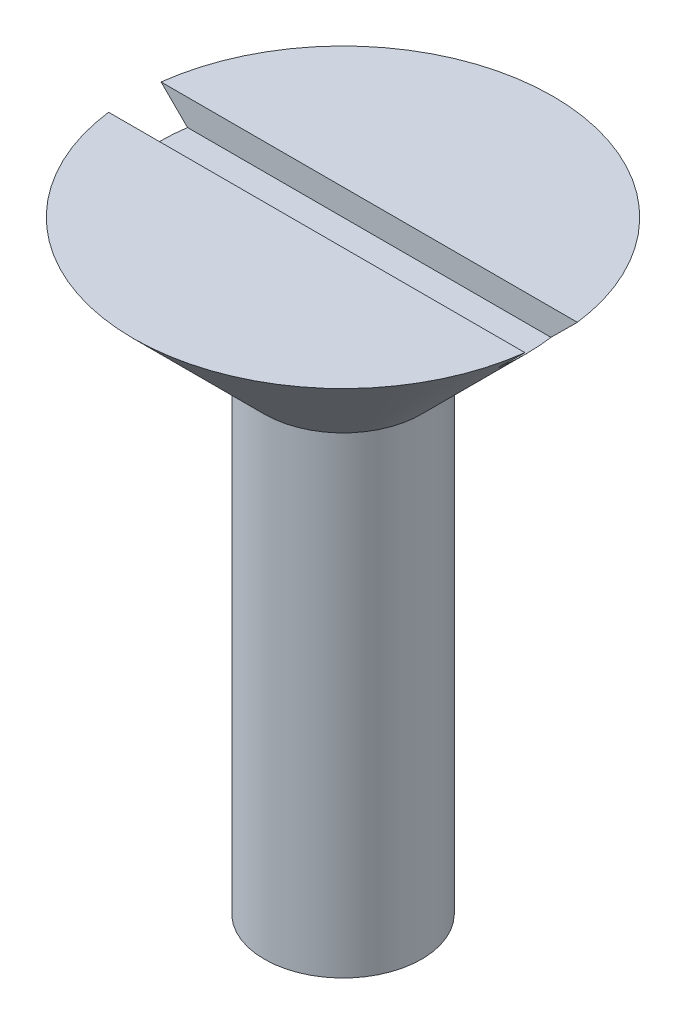
ISO-10303-21;
HEADER;
FILE_DESCRIPTION(('STEP AP214'),'2;1');
FILE_NAME('part.step','',(''),(''),'','','');
FILE_SCHEMA(('AUTOMOTIVE_DESIGN { 1 0 10303 214 1 1 1 1 }'));
ENDSEC;
DATA;
#1=APPLICATION_CONTEXT('core data for automotive mechanical design processes');
#2=APPLICATION_PROTOCOL_DEFINITION('international standard','automotive_design',2000,#1);
#3=PRODUCT_CONTEXT('',#1,'mechanical');
#4=PRODUCT('Part','Part','',(#3));
#5=PRODUCT_RELATED_PRODUCT_CATEGORY('part','',(#4));
#6=PRODUCT_DEFINITION_FORMATION('','',#4);
#7=PRODUCT_DEFINITION_CONTEXT('part definition',#1,'design');
#8=PRODUCT_DEFINITION('design','',#6,#7);
#9=PRODUCT_DEFINITION_SHAPE('','',#8);
#10=(LENGTH_UNIT() NAMED_UNIT(*) SI_UNIT(.MILLI.,.METRE.));
#11=(NAMED_UNIT(*) PLANE_ANGLE_UNIT() SI_UNIT($,.RADIAN.));
#12=(NAMED_UNIT(*) SI_UNIT($,.STERADIAN.) SOLID_ANGLE_UNIT());
#13=UNCERTAINTY_MEASURE_WITH_UNIT(LENGTH_MEASURE(1.E-05),#10,'distance_accuracy_value','');
#14=(GEOMETRIC_REPRESENTATION_CONTEXT(3) GLOBAL_UNCERTAINTY_ASSIGNED_CONTEXT((#13)) GLOBAL_UNIT_ASSIGNED_CONTEXT((#10,
#11,#12)) REPRESENTATION_CONTEXT('',''));
#15=CARTESIAN_POINT('',(0.,0.,0.));
#16=DIRECTION('',(0.,0.,1.));
#17=DIRECTION('',(1.,0.,0.));
#18=AXIS2_PLACEMENT_3D('',#15,#16,#17);
#19=CARTESIAN_POINT('',(0.,14.,0.));
#20=DIRECTION('',(0.,-1.,0.));
#21=DIRECTION('',(0.,0.,-1.));
#22=AXIS2_PLACEMENT_3D('',#19,#20,#21);
#23=PLANE('',#22);
#24=CARTESIAN_POINT('',(0.,14.,0.));
#25=DIRECTION('',(0.,1.,0.));
#26=DIRECTION('',(0.,0.,1.));
#27=AXIS2_PLACEMENT_3D('',#24,#25,#26);
#28=CIRCLE('',#27,7.99999999999998);
#29=CARTESIAN_POINT('',(7.93725393319376,14.,-1.));
#30=VERTEX_POINT('',#29);
#31=CARTESIAN_POINT('',(-7.93725393319375,14.,-1.));
#32=VERTEX_POINT('',#31);
#33=EDGE_CURVE('E92',#30,#32,#28,.T.);
#34=ORIENTED_EDGE('',*,*,#33,.T.);
#35=DIRECTION('',(1.,0.,0.));
#36=VECTOR('',#35,1.);
#37=CARTESIAN_POINT('',(0.,14.,-1.));
#38=LINE('',#37,#36);
#39=EDGE_CURVE('E81',#32,#30,#38,.T.);
#40=ORIENTED_EDGE('',*,*,#39,.T.);
#41=EDGE_LOOP('',(#34,#40));
#42=FACE_BOUND('',#41,.T.);
#43=ADVANCED_FACE('F33',(#42),#23,.F.);
#44=CARTESIAN_POINT('',(0.,9.,0.));
#45=DIRECTION('',(0.,1.,0.));
#46=DIRECTION('',(0.,0.,1.));
#47=AXIS2_PLACEMENT_3D('',#44,#45,#46);
#48=CONICAL_SURFACE('',#47,3.,0.785398163397447);
#49=CARTESIAN_POINT('',(0.,13.,0.));
#50=DIRECTION('',(0.,-1.,0.));
#51=DIRECTION('',(0.,0.,-1.));
#52=AXIS2_PLACEMENT_3D('',#49,#50,#51);
#53=CIRCLE('',#52,6.99999999999998);
#54=CARTESIAN_POINT('',(-6.92820323027549,13.,1.));
#55=VERTEX_POINT('',#54);
#56=CARTESIAN_POINT('',(-6.92820323027549,13.,-1.));
#57=VERTEX_POINT('',#56);
#58=EDGE_CURVE('E11',#55,#57,#53,.T.);
#59=ORIENTED_EDGE('',*,*,#58,.T.);
#60=CARTESIAN_POINT('',(17.5905302687198,23.6189317251288,-1.));
#61=CARTESIAN_POINT('',(16.9921066626598,23.0214800232055,-1.));
#62=CARTESIAN_POINT('',(16.3936408075219,22.4240706192128,-1.));
#63=CARTESIAN_POINT('',(15.196565027162,21.2293826627781,-1.));
#64=CARTESIAN_POINT('',(14.5979551003902,20.6321041118889,-1.));
#65=CARTESIAN_POINT('',(13.4003937558491,19.4375866359061,-1.));
#66=CARTESIAN_POINT('',(12.8014422900068,18.8403477590018,-1.));
#67=CARTESIAN_POINT('',(11.603257334266,17.6461661568175,-1.));
#68=CARTESIAN_POINT('',(11.0040238475453,17.0492234283494,-1.));
#69=CARTESIAN_POINT('',(9.7847582236038,15.8355425663744,-1.));
#70=CARTESIAN_POINT('',(9.16471041380419,15.2188201700583,-1.));
#71=CARTESIAN_POINT('',(8.23396656445527,14.2943918251065,-1.));
#72=CARTESIAN_POINT('',(7.92360124411733,13.9863529550664,-1.));
#73=CARTESIAN_POINT('',(7.30255555881147,13.3705950160447,-1.));
#74=CARTESIAN_POINT('',(6.99187519491007,13.0628759459874,-1.));
#75=CARTESIAN_POINT('',(6.37010401008026,12.4479526103779,-1.));
#76=CARTESIAN_POINT('',(6.05901326326565,12.1407482699372,-1.));
#77=CARTESIAN_POINT('',(5.43610970373195,11.5270643796558,-1.));
#78=CARTESIAN_POINT('',(5.12429688170295,11.2205848392643,-1.));
#79=CARTESIAN_POINT('',(4.49951156578897,10.6088449025209,-1.));
#80=CARTESIAN_POINT('',(4.18653914373778,10.3035844330072,-1.));
#81=CARTESIAN_POINT('',(3.7154035193183,9.84743132198102,-1.));
#82=CARTESIAN_POINT('',(3.55808044623061,9.69567144236141,-1.));
#83=CARTESIAN_POINT('',(3.24261115812736,9.39301012036289,-1.));
#84=CARTESIAN_POINT('',(3.08446494993228,9.24210867089266,-1.));
#85=CARTESIAN_POINT('',(2.88297041268774,9.05144754805751,-1.));
#86=CARTESIAN_POINT('',(2.84020462566703,9.01107215088935,-1.));
#87=CARTESIAN_POINT('',(2.75456797785924,8.93043274981185,-1.));
#88=CARTESIAN_POINT('',(2.71169711684696,8.89016874614164,-1.));
#89=CARTESIAN_POINT('',(2.58290562731864,8.7695652821317,-1.));
#90=CARTESIAN_POINT('',(2.49680723382454,8.68941545042782,-1.));
#91=CARTESIAN_POINT('',(2.3242779436887,8.53005409276721,-1.));
#92=CARTESIAN_POINT('',(2.23784912386126,8.45084032443019,-1.));
#93=CARTESIAN_POINT('',(2.06415658614781,8.29334065089302,-1.));
#94=CARTESIAN_POINT('',(1.97689289761326,8.21505471328821,-1.));
#95=CARTESIAN_POINT('',(1.77142747941351,8.03343659901735,-1.));
#96=CARTESIAN_POINT('',(1.65276973736519,7.93061397406147,-1.));
#97=CARTESIAN_POINT('',(1.47184772133814,7.77911885803057,-1.));
#98=CARTESIAN_POINT('',(1.41085897886966,7.72892683246099,-1.));
#99=CARTESIAN_POINT('',(1.28772085809631,7.62999161500929,-1.));
#100=CARTESIAN_POINT('',(1.22557159472625,7.58124828087892,-1.));
#101=CARTESIAN_POINT('',(1.09893092584816,7.4852336783047,-1.));
#102=CARTESIAN_POINT('',(1.03442014565076,7.43798778887903,-1.));
#103=CARTESIAN_POINT('',(0.903077346685914,7.34659413826808,-1.));
#104=CARTESIAN_POINT('',(0.836242364310852,7.30245056688251,-1.));
#105=CARTESIAN_POINT('',(0.700082271665347,7.21951165683876,-1.));
#106=CARTESIAN_POINT('',(0.630783821373029,7.18067320865143,-1.));
#107=CARTESIAN_POINT('',(0.488249961599324,7.11110262221831,-1.));
#108=CARTESIAN_POINT('',(0.415027354221666,7.08034585094755,-1.));
#109=CARTESIAN_POINT('',(0.305295681949306,7.04505988461626,-1.));
#110=CARTESIAN_POINT('',(0.270458983603069,7.03536077383307,-1.));
#111=CARTESIAN_POINT('',(0.200025610437724,7.01923304310288,-1.));
#112=CARTESIAN_POINT('',(0.164429059807317,7.01280389292049,-1.));
#113=CARTESIAN_POINT('',(0.0929594885366785,7.00369029330408,-1.));
#114=CARTESIAN_POINT('',(0.0570892602674354,7.00098438681967,-1.));
#115=CARTESIAN_POINT('',(-0.0147355703830216,6.99946402167183,-1.));
#116=CARTESIAN_POINT('',(-0.0506901721490982,7.00064953472498,-1.));
#117=CARTESIAN_POINT('',(-0.122126081683583,7.00680294241904,-1.));
#118=CARTESIAN_POINT('',(-0.157608683251817,7.01175616902627,-1.));
#119=CARTESIAN_POINT('',(-0.227933015011514,7.0250654724445,-1.));
#120=CARTESIAN_POINT('',(-0.262774448908409,7.03342308315759,-1.));
#121=CARTESIAN_POINT('',(-0.331868652820795,7.05310521473586,-1.));
#122=CARTESIAN_POINT('',(-0.366115319167721,7.06445081811461,-1.));
#123=CARTESIAN_POINT('',(-0.433697243700892,7.08954549868784,-1.));
#124=CARTESIAN_POINT('',(-0.467032628448915,7.10329424014533,-1.));
#125=CARTESIAN_POINT('',(-0.556369473104637,7.14323682745065,-1.));
#126=CARTESIAN_POINT('',(-0.611531502099558,7.17129912801516,-1.));
#127=CARTESIAN_POINT('',(-0.719746479188068,7.23126222613431,-1.));
#128=CARTESIAN_POINT('',(-0.772797073886971,7.26316715559846,-1.));
#129=CARTESIAN_POINT('',(-0.877378905629743,7.3297232706074,-1.));
#130=CARTESIAN_POINT('',(-0.928904513833071,7.36438322182091,-1.));
#131=CARTESIAN_POINT('',(-1.03064155428344,7.43558477652545,-1.));
#132=CARTESIAN_POINT('',(-1.08085273057067,7.47212674245088,-1.));
#133=CARTESIAN_POINT('',(-1.18069676212704,7.54691384093614,-1.));
#134=CARTESIAN_POINT('',(-1.23032026389647,7.58517139936918,-1.));
#135=CARTESIAN_POINT('',(-1.32875090858554,7.6627271929109,-1.));
#136=CARTESIAN_POINT('',(-1.3775579807495,7.70202551746274,-1.));
#137=CARTESIAN_POINT('',(-1.47440842921627,7.78132235461105,-1.));
#138=CARTESIAN_POINT('',(-1.52245332021948,7.82131902199806,-1.));
#139=CARTESIAN_POINT('',(-1.61801935988398,7.90192803586136,-1.));
#140=CARTESIAN_POINT('',(-1.66554052949055,7.94254035756022,-1.));
#141=CARTESIAN_POINT('',(-1.8054824192699,8.06338835106973,-1.));
#142=CARTESIAN_POINT('',(-1.89730724317153,8.14431360555889,-1.));
#143=CARTESIAN_POINT('',(-2.07985098832569,8.3074037707118,-1.));
#144=CARTESIAN_POINT('',(-2.17056985929147,8.38956873736692,-1.));
#145=CARTESIAN_POINT('',(-2.35122191691888,8.5547816615605,-1.));
#146=CARTESIAN_POINT('',(-2.4411549935154,8.63782973929464,-1.));
#147=CARTESIAN_POINT('',(-2.62042933743661,8.8045627437366,-1.));
#148=CARTESIAN_POINT('',(-2.7097705994131,8.88824767618501,-1.));
#149=CARTESIAN_POINT('',(-2.97733915094248,9.14020804513012,-1.));
#150=CARTESIAN_POINT('',(-3.15489818069136,9.30919266724204,-1.));
#151=CARTESIAN_POINT('',(-3.50891525001108,9.64827881532111,-1.));
#152=CARTESIAN_POINT('',(-3.68537337815984,9.81838024910975,-1.));
#153=CARTESIAN_POINT('',(-4.03579332978233,10.1576096662065,-1.));
#154=CARTESIAN_POINT('',(-4.20976238753321,10.3267301803555,-1.));
#155=CARTESIAN_POINT('',(-4.55721168919067,10.6654794736863,-1.));
#156=CARTESIAN_POINT('',(-4.73069192269327,10.8351082635297,-1.));
#157=CARTESIAN_POINT('',(-5.25043504390502,11.3443635571965,-1.));
#158=CARTESIAN_POINT('',(-5.59617242203998,11.6845261954296,-1.));
#159=CARTESIAN_POINT('',(-6.42446591619127,12.5013362513776,-1.));
#160=CARTESIAN_POINT('',(-6.90664843932399,12.9783620376579,-1.));
#161=CARTESIAN_POINT('',(-7.87020912978405,13.9332280726438,-1.));
#162=CARTESIAN_POINT('',(-8.3515872943149,14.4110683241695,-1.));
#163=CARTESIAN_POINT('',(-9.31396340509058,15.3673365963454,-1.));
#164=CARTESIAN_POINT('',(-9.79496124833594,15.8457647206249,-1.));
#165=CARTESIAN_POINT('',(-10.7566474889435,16.802930678605,-1.));
#166=CARTESIAN_POINT('',(-11.2373358866711,17.2816685119385,-1.));
#167=CARTESIAN_POINT('',(-12.2076531683375,18.2484719747768,-1.));
#168=CARTESIAN_POINT('',(-12.6972780186468,18.7365416521831,-1.));
#169=CARTESIAN_POINT('',(-13.6763743158692,19.7128352301166,-1.));
#170=CARTESIAN_POINT('',(-14.1658457627211,20.2010591307051,-1.));
#171=CARTESIAN_POINT('',(-15.1445674016934,21.1775099268687,-1.));
#172=CARTESIAN_POINT('',(-15.6338176188142,21.6657367973865,-1.));
#173=CARTESIAN_POINT('',(-16.6122319660961,22.6422763546546,-1.));
#174=CARTESIAN_POINT('',(-17.1013960962956,23.1305890413662,-1.));
#175=CARTESIAN_POINT('',(-17.5905302687198,23.6189317251288,-1.));
#176=B_SPLINE_CURVE_WITH_KNOTS('',3,(#60,#61,#62,#63,#64,#65,#66,#67,#68,#69,#70,#71,#72,#73,
#74,#75,#76,#77,#78,#79,#80,#81,#82,#83,#84,#85,#86,#87,#88,#89,#90,#91,#92,#93,#94,#95,#96,#97,
#98,#99,#100,#101,#102,#103,#104,#105,#106,#107,#108,#109,#110,#111,#112,#113,#114,#115,#116,
#117,#118,#119,#120,#121,#122,#123,#124,#125,#126,#127,#128,#129,#130,#131,#132,#133,#134,#135,
#136,#137,#138,#139,#140,#141,#142,#143,#144,#145,#146,#147,#148,#149,#150,#151,#152,#153,#154,
#155,#156,#157,#158,#159,#160,#161,#162,#163,#164,#165,#166,#167,#168,#169,#170,#171,#172,#173,
#174,#175),.UNSPECIFIED.,.F.,.F.,(4,2,2,2,2,2,2,2,2,2,2,2,2,2,2,2,2,2,2,2,2,2,2,2,2,2,2,2,2,2,2,
2,2,2,2,2,2,2,2,2,2,2,2,2,2,2,2,2,2,2,2,2,2,2,2,2,2,4),(0.,2.53683547484964,5.07369958126534,
7.61120501536626,10.1486825124165,12.7722771985783,14.0841197040112,15.3959577832198,
16.707584715461,18.0192286540663,19.330792655159,19.9865611093225,20.6423241384291,
20.8187659370602,20.9952081141862,21.3480971860885,21.6998053647098,22.0515012234452,
22.5224662329011,22.759410956754,22.9963323374189,23.2361588182638,23.4763032056306,
23.7143624713616,23.9516874848543,24.0600441435376,24.1683832262085,24.2760952982039,
24.3838065873334,24.4911006797618,24.5984431689025,24.7065643328738,24.8146704035377,
25.0000887091543,25.1857082022667,25.371943935063,25.5582156678338,25.7461740706937,
25.9341486794019,26.12168521691,26.309214226816,26.6763815899282,27.0435655860253,
27.41080021412,27.7780381563857,28.5133831976557,29.2486682900513,29.9765422639681,
30.704431614447,32.1594905268424,34.1943063558045,36.229129244471,38.2643861528643,
40.2996406531458,42.3736465207807,44.4476532154235,46.5211963714275,48.5947386001912),.UNSPECIFIED.);
#177=EDGE_CURVE('E97',#57,#32,#176,.T.);
#178=ORIENTED_EDGE('',*,*,#177,.T.);
#179=ORIENTED_EDGE('',*,*,#33,.F.);
#180=CARTESIAN_POINT('',(6.92820323027549,13.,-1.));
#181=VERTEX_POINT('',#180);
#182=EDGE_CURVE('E93',#30,#181,#176,.T.);
#183=ORIENTED_EDGE('',*,*,#182,.T.);
#184=CARTESIAN_POINT('',(6.92820323027549,13.,1.));
#185=VERTEX_POINT('',#184);
#186=EDGE_CURVE('E38',#181,#185,#53,.T.);
#187=ORIENTED_EDGE('',*,*,#186,.T.);
#188=CARTESIAN_POINT('',(-17.5905302687198,23.6189317251288,1.));
#189=CARTESIAN_POINT('',(-16.9921066626598,23.0214800232055,1.));
#190=CARTESIAN_POINT('',(-16.3936408075219,22.4240706192128,1.));
#191=CARTESIAN_POINT('',(-15.196565027162,21.2293826627781,1.));
#192=CARTESIAN_POINT('',(-14.5979551003902,20.6321041118889,1.));
#193=CARTESIAN_POINT('',(-13.4003937558491,19.4375866359061,1.));
#194=CARTESIAN_POINT('',(-12.8014422900068,18.8403477590017,1.));
#195=CARTESIAN_POINT('',(-11.603257334266,17.6461661568175,1.));
#196=CARTESIAN_POINT('',(-11.0040238475453,17.0492234283494,1.));
#197=CARTESIAN_POINT('',(-9.78475822360379,15.8355425663744,1.));
#198=CARTESIAN_POINT('',(-9.16471041380419,15.2188201700583,1.));
#199=CARTESIAN_POINT('',(-8.23396656445526,14.2943918251065,1.));
#200=CARTESIAN_POINT('',(-7.92360124411733,13.9863529550664,1.));
#201=CARTESIAN_POINT('',(-7.30255555881147,13.3705950160447,1.));
#202=CARTESIAN_POINT('',(-6.99187519491006,13.0628759459874,1.));
#203=CARTESIAN_POINT('',(-6.37010401008026,12.4479526103779,1.));
#204=CARTESIAN_POINT('',(-6.05901326326565,12.1407482699372,1.));
#205=CARTESIAN_POINT('',(-5.43610970373195,11.5270643796558,1.));
#206=CARTESIAN_POINT('',(-5.12429688170295,11.2205848392643,1.));
#207=CARTESIAN_POINT('',(-4.49951156578898,10.6088449025209,1.));
#208=CARTESIAN_POINT('',(-4.18653914373779,10.3035844330072,1.));
#209=CARTESIAN_POINT('',(-3.7154035193183,9.84743132198102,1.));
#210=CARTESIAN_POINT('',(-3.55808044623061,9.69567144236142,1.));
#211=CARTESIAN_POINT('',(-3.24261115812736,9.39301012036289,1.));
#212=CARTESIAN_POINT('',(-3.08446494993228,9.24210867089267,1.));
#213=CARTESIAN_POINT('',(-2.88297041268774,9.05144754805751,1.));
#214=CARTESIAN_POINT('',(-2.84020462566703,9.01107215088935,1.));
#215=CARTESIAN_POINT('',(-2.75456797785924,8.93043274981185,1.));
#216=CARTESIAN_POINT('',(-2.71169711684696,8.89016874614164,1.));
#217=CARTESIAN_POINT('',(-2.58290562731864,8.7695652821317,1.));
#218=CARTESIAN_POINT('',(-2.49680723382454,8.68941545042782,1.));
#219=CARTESIAN_POINT('',(-2.3242779436887,8.53005409276721,1.));
#220=CARTESIAN_POINT('',(-2.23784912386126,8.45084032443019,1.));
#221=CARTESIAN_POINT('',(-2.06415658614781,8.29334065089302,1.));
#222=CARTESIAN_POINT('',(-1.97689289761326,8.21505471328821,1.));
#223=CARTESIAN_POINT('',(-1.77142747941351,8.03343659901735,1.));
#224=CARTESIAN_POINT('',(-1.65276973736519,7.93061397406147,1.));
#225=CARTESIAN_POINT('',(-1.47184772133814,7.77911885803057,1.));
#226=CARTESIAN_POINT('',(-1.41085897886966,7.72892683246099,1.));
#227=CARTESIAN_POINT('',(-1.28772085809631,7.62999161500929,1.));
#228=CARTESIAN_POINT('',(-1.22557159472625,7.58124828087892,1.));
#229=CARTESIAN_POINT('',(-1.09893092584816,7.4852336783047,1.));
#230=CARTESIAN_POINT('',(-1.03442014565076,7.43798778887903,1.));
#231=CARTESIAN_POINT('',(-0.903077346685913,7.34659413826808,1.));
#232=CARTESIAN_POINT('',(-0.836242364310851,7.30245056688251,1.));
#233=CARTESIAN_POINT('',(-0.700082271665346,7.21951165683876,1.));
#234=CARTESIAN_POINT('',(-0.630783821373028,7.18067320865143,1.));
#235=CARTESIAN_POINT('',(-0.488249961599324,7.11110262221831,1.));
#236=CARTESIAN_POINT('',(-0.415027354221666,7.08034585094755,1.));
#237=CARTESIAN_POINT('',(-0.305295681949306,7.04505988461626,1.));
#238=CARTESIAN_POINT('',(-0.27045898360307,7.03536077383307,1.));
#239=CARTESIAN_POINT('',(-0.200025610437726,7.01923304310289,1.));
#240=CARTESIAN_POINT('',(-0.164429059807318,7.0128038929205,1.));
#241=CARTESIAN_POINT('',(-0.0929594885366797,7.00369029330408,1.));
#242=CARTESIAN_POINT('',(-0.0570892602674369,7.00098438681967,1.));
#243=CARTESIAN_POINT('',(0.0147355703830209,6.99946402167183,1.));
#244=CARTESIAN_POINT('',(0.0506901721490985,7.00064953472498,1.));
#245=CARTESIAN_POINT('',(0.122126081683585,7.00680294241904,1.));
#246=CARTESIAN_POINT('',(0.157608683251821,7.01175616902627,1.));
#247=CARTESIAN_POINT('',(0.227933015011519,7.0250654724445,1.));
#248=CARTESIAN_POINT('',(0.262774448908414,7.03342308315759,1.));
#249=CARTESIAN_POINT('',(0.331868652820799,7.05310521473586,1.));
#250=CARTESIAN_POINT('',(0.366115319167723,7.06445081811461,1.));
#251=CARTESIAN_POINT('',(0.433697243700893,7.08954549868784,1.));
#252=CARTESIAN_POINT('',(0.467032628448916,7.10329424014533,1.));
#253=CARTESIAN_POINT('',(0.556369473104638,7.14323682745065,1.));
#254=CARTESIAN_POINT('',(0.61153150209956,7.17129912801516,1.));
#255=CARTESIAN_POINT('',(0.71974647918807,7.23126222613431,1.));
#256=CARTESIAN_POINT('',(0.772797073886973,7.26316715559846,1.));
#257=CARTESIAN_POINT('',(0.877378905629745,7.3297232706074,1.));
#258=CARTESIAN_POINT('',(0.928904513833073,7.36438322182091,1.));
#259=CARTESIAN_POINT('',(1.03064155428344,7.43558477652545,1.));
#260=CARTESIAN_POINT('',(1.08085273057067,7.47212674245088,1.));
#261=CARTESIAN_POINT('',(1.18069676212704,7.54691384093614,1.));
#262=CARTESIAN_POINT('',(1.23032026389647,7.58517139936918,1.));
#263=CARTESIAN_POINT('',(1.32875090858554,7.6627271929109,1.));
#264=CARTESIAN_POINT('',(1.37755798074951,7.70202551746274,1.));
#265=CARTESIAN_POINT('',(1.47440842921627,7.78132235461105,1.));
#266=CARTESIAN_POINT('',(1.52245332021948,7.82131902199807,1.));
#267=CARTESIAN_POINT('',(1.61801935988398,7.90192803586137,1.));
#268=CARTESIAN_POINT('',(1.66554052949055,7.94254035756022,1.));
#269=CARTESIAN_POINT('',(1.8054824192699,8.06338835106973,1.));
#270=CARTESIAN_POINT('',(1.89730724317153,8.1443136055589,1.));
#271=CARTESIAN_POINT('',(2.0798509883257,8.3074037707118,1.));
#272=CARTESIAN_POINT('',(2.17056985929148,8.38956873736693,1.));
#273=CARTESIAN_POINT('',(2.35122191691889,8.5547816615605,1.));
#274=CARTESIAN_POINT('',(2.44115499351541,8.63782973929465,1.));
#275=CARTESIAN_POINT('',(2.62042933743662,8.80456274373661,1.));
#276=CARTESIAN_POINT('',(2.70977059941311,8.88824767618502,1.));
#277=CARTESIAN_POINT('',(2.97733915094249,9.14020804513013,1.));
#278=CARTESIAN_POINT('',(3.15489818069137,9.30919266724205,1.));
#279=CARTESIAN_POINT('',(3.50891525001109,9.64827881532112,1.));
#280=CARTESIAN_POINT('',(3.68537337815985,9.81838024910976,1.));
#281=CARTESIAN_POINT('',(4.03579332978234,10.1576096662065,1.));
#282=CARTESIAN_POINT('',(4.20976238753322,10.3267301803555,1.));
#283=CARTESIAN_POINT('',(4.55721168919068,10.6654794736863,1.));
#284=CARTESIAN_POINT('',(4.73069192269328,10.8351082635297,1.));
#285=CARTESIAN_POINT('',(5.25043504390503,11.3443635571965,1.));
#286=CARTESIAN_POINT('',(5.59617242203999,11.6845261954296,1.));
#287=CARTESIAN_POINT('',(6.42446591619129,12.5013362513776,1.));
#288=CARTESIAN_POINT('',(6.90664843932401,12.9783620376579,1.));
#289=CARTESIAN_POINT('',(7.87020912978406,13.9332280726438,1.));
#290=CARTESIAN_POINT('',(8.35158729431491,14.4110683241696,1.));
#291=CARTESIAN_POINT('',(9.31396340509058,15.3673365963454,1.));
#292=CARTESIAN_POINT('',(9.79496124833594,15.8457647206249,1.));
#293=CARTESIAN_POINT('',(10.7566474889435,16.802930678605,1.));
#294=CARTESIAN_POINT('',(11.2373358866712,17.2816685119385,1.));
#295=CARTESIAN_POINT('',(12.2076531683375,18.2484719747768,1.));
#296=CARTESIAN_POINT('',(12.6972780186468,18.7365416521831,1.));
#297=CARTESIAN_POINT('',(13.6763743158692,19.7128352301166,1.));
#298=CARTESIAN_POINT('',(14.1658457627211,20.2010591307051,1.));
#299=CARTESIAN_POINT('',(15.1445674016934,21.1775099268687,1.));
#300=CARTESIAN_POINT('',(15.6338176188142,21.6657367973865,1.));
#301=CARTESIAN_POINT('',(16.6122319660961,22.6422763546546,1.));
#302=CARTESIAN_POINT('',(17.1013960962956,23.1305890413662,1.));
#303=CARTESIAN_POINT('',(17.5905302687198,23.6189317251288,1.));
#304=B_SPLINE_CURVE_WITH_KNOTS('',3,(#188,#189,#190,#191,#192,#193,#194,#195,#196,#197,#198,
#199,#200,#201,#202,#203,#204,#205,#206,#207,#208,#209,#210,#211,#212,#213,#214,#215,#216,#217,
#218,#219,#220,#221,#222,#223,#224,#225,#226,#227,#228,#229,#230,#231,#232,#233,#234,#235,#236,
#237,#238,#239,#240,#241,#242,#243,#244,#245,#246,#247,#248,#249,#250,#251,#252,#253,#254,#255,
#256,#257,#258,#259,#260,#261,#262,#263,#264,#265,#266,#267,#268,#269,#270,#271,#272,#273,#274,
#275,#276,#277,#278,#279,#280,#281,#282,#283,#284,#285,#286,#287,#288,#289,#290,#291,#292,#293,
#294,#295,#296,#297,#298,#299,#300,#301,#302,#303),.UNSPECIFIED.,.F.,.F.,(4,2,2,2,2,2,2,2,2,2,2,
2,2,2,2,2,2,2,2,2,2,2,2,2,2,2,2,2,2,2,2,2,2,2,2,2,2,2,2,2,2,2,2,2,2,2,2,2,2,2,2,2,2,2,2,2,2,4),
(0.,2.53683547484964,5.07369958126534,7.61120501536626,10.1486825124165,12.7722771985783,
14.0841197040112,15.3959577832198,16.707584715461,18.0192286540663,19.330792655159,
19.9865611093225,20.6423241384291,20.8187659370602,20.9952081141862,21.3480971860884,
21.6998053647098,22.0515012234452,22.5224662329011,22.759410956754,22.9963323374189,
23.2361588182638,23.4763032056306,23.7143624713616,23.9516874848543,24.0600441435376,
24.1683832262085,24.2760952982039,24.3838065873333,24.4911006797618,24.5984431689025,
24.7065643328738,24.8146704035377,25.0000887091543,25.1857082022667,25.3719439350629,
25.5582156678338,25.7461740706937,25.9341486794019,26.12168521691,26.309214226816,
26.6763815899282,27.0435655860253,27.41080021412,27.7780381563857,28.5133831976557,
29.2486682900513,29.9765422639681,30.704431614447,32.1594905268424,34.1943063558045,
36.229129244471,38.2643861528643,40.2996406531458,42.3736465207807,44.4476532154235,
46.5211963714275,48.5947386001911),.UNSPECIFIED.);
#305=CARTESIAN_POINT('',(7.93725393319376,14.,1.));
#306=VERTEX_POINT('',#305);
#307=EDGE_CURVE('E76',#185,#306,#304,.T.);
#308=ORIENTED_EDGE('',*,*,#307,.T.);
#309=CARTESIAN_POINT('',(-7.93725393319375,14.,1.));
#310=VERTEX_POINT('',#309);
#311=EDGE_CURVE('E87',#310,#306,#28,.T.);
#312=ORIENTED_EDGE('',*,*,#311,.F.);
#313=EDGE_CURVE('E49',#310,#55,#304,.T.);
#314=ORIENTED_EDGE('',*,*,#313,.T.);
#315=EDGE_LOOP('',(#59,#178,#179,#183,#187,#308,#312,#314));
#316=FACE_BOUND('',#315,.T.);
#317=CARTESIAN_POINT('',(0.,9.,0.));
#318=DIRECTION('',(0.,1.,0.));
#319=DIRECTION('',(0.,0.,1.));
#320=AXIS2_PLACEMENT_3D('',#317,#318,#319);
#321=CIRCLE('',#320,3.);
#322=CARTESIAN_POINT('',(0.,9.,3.));
#323=VERTEX_POINT('',#322);
#324=EDGE_CURVE('E82',#323,#323,#321,.T.);
#325=ORIENTED_EDGE('',*,*,#324,.T.);
#326=EDGE_LOOP('',(#325));
#327=FACE_BOUND('',#326,.T.);
#328=ADVANCED_FACE('F35',(#316,#327),#48,.T.);
#329=CARTESIAN_POINT('',(0.,9.,0.));
#330=DIRECTION('',(0.,1.,0.));
#331=DIRECTION('',(0.,0.,1.));
#332=AXIS2_PLACEMENT_3D('',#329,#330,#331);
#333=CYLINDRICAL_SURFACE('',#332,3.);
#334=ORIENTED_EDGE('',*,*,#324,.F.);
#335=EDGE_LOOP('',(#334));
#336=FACE_BOUND('',#335,.T.);
#337=CARTESIAN_POINT('',(0.,-9.,0.));
#338=DIRECTION('',(0.,1.,0.));
#339=DIRECTION('',(0.,0.,1.));
#340=AXIS2_PLACEMENT_3D('',#337,#338,#339);
#341=CIRCLE('',#340,3.);
#342=CARTESIAN_POINT('',(0.,-9.,3.));
#343=VERTEX_POINT('',#342);
#344=EDGE_CURVE('E96',#343,#343,#341,.T.);
#345=ORIENTED_EDGE('',*,*,#344,.T.);
#346=EDGE_LOOP('',(#345));
#347=FACE_BOUND('',#346,.T.);
#348=ADVANCED_FACE('F131',(#336,#347),#333,.T.);
#349=CARTESIAN_POINT('',(0.,-10.7320508075689,0.));
#350=DIRECTION('',(0.,1.,0.));
#351=DIRECTION('',(0.,0.,1.));
#352=AXIS2_PLACEMENT_3D('',#349,#350,#351);
#353=CONICAL_SURFACE('',#352,0.,1.0471975511966);
#354=ORIENTED_EDGE('',*,*,#344,.F.);
#355=EDGE_LOOP('',(#354));
#356=FACE_BOUND('',#355,.T.);
#357=CARTESIAN_POINT('',(0.,-10.7320508075689,0.));
#358=VERTEX_POINT('',#357);
#359=VERTEX_LOOP('',#358);
#360=FACE_BOUND('',#359,.T.);
#361=ADVANCED_FACE('F129',(#356,#360),#353,.T.);
#362=ORIENTED_EDGE('',*,*,#311,.T.);
#363=DIRECTION('',(-1.,0.,0.));
#364=VECTOR('',#363,1.);
#365=CARTESIAN_POINT('',(0.,14.,1.));
#366=LINE('',#365,#364);
#367=EDGE_CURVE('E73',#306,#310,#366,.T.);
#368=ORIENTED_EDGE('',*,*,#367,.T.);
#369=EDGE_LOOP('',(#362,#368));
#370=FACE_BOUND('',#369,.T.);
#371=ADVANCED_FACE('F91',(#370),#23,.F.);
#372=CARTESIAN_POINT('',(-9.,13.,1.));
#373=DIRECTION('',(0.,-1.,0.));
#374=DIRECTION('',(0.,0.,-1.));
#375=AXIS2_PLACEMENT_3D('',#372,#373,#374);
#376=PLANE('',#375);
#377=DIRECTION('',(1.,0.,0.));
#378=VECTOR('',#377,1.);
#379=CARTESIAN_POINT('',(-9.,13.,-1.));
#380=LINE('',#379,#378);
#381=EDGE_CURVE('E89',#57,#181,#380,.T.);
#382=ORIENTED_EDGE('',*,*,#381,.F.);
#383=ORIENTED_EDGE('',*,*,#58,.F.);
#384=DIRECTION('',(1.,0.,0.));
#385=VECTOR('',#384,1.);
#386=CARTESIAN_POINT('',(-9.,13.,1.));
#387=LINE('',#386,#385);
#388=EDGE_CURVE('E119',#55,#185,#387,.T.);
#389=ORIENTED_EDGE('',*,*,#388,.T.);
#390=ORIENTED_EDGE('',*,*,#186,.F.);
#391=EDGE_LOOP('',(#382,#383,#389,#390));
#392=FACE_BOUND('',#391,.T.);
#393=ADVANCED_FACE('F126',(#392),#376,.F.);
#394=CARTESIAN_POINT('',(-9.,13.,-1.));
#395=DIRECTION('',(0.,0.,-1.));
#396=DIRECTION('',(-1.,0.,0.));
#397=AXIS2_PLACEMENT_3D('',#394,#395,#396);
#398=PLANE('',#397);
#399=ORIENTED_EDGE('',*,*,#39,.F.);
#400=ORIENTED_EDGE('',*,*,#177,.F.);
#401=ORIENTED_EDGE('',*,*,#381,.T.);
#402=ORIENTED_EDGE('',*,*,#182,.F.);
#403=EDGE_LOOP('',(#399,#400,#401,#402));
#404=FACE_BOUND('',#403,.T.);
#405=ADVANCED_FACE('F125',(#404),#398,.F.);
#406=CARTESIAN_POINT('',(-9.,14.,1.));
#407=DIRECTION('',(0.,0.,1.));
#408=DIRECTION('',(1.,0.,0.));
#409=AXIS2_PLACEMENT_3D('',#406,#407,#408);
#410=PLANE('',#409);
#411=ORIENTED_EDGE('',*,*,#367,.F.);
#412=ORIENTED_EDGE('',*,*,#307,.F.);
#413=ORIENTED_EDGE('',*,*,#388,.F.);
#414=ORIENTED_EDGE('',*,*,#313,.F.);
#415=EDGE_LOOP('',(#411,#412,#413,#414));
#416=FACE_BOUND('',#415,.T.);
#417=ADVANCED_FACE('F75',(#416),#410,.F.);
#418=CLOSED_SHELL('',(#43,#328,#348,#361,#371,#393,#405,#417));
#419=MANIFOLD_SOLID_BREP('B2',#418);
#420=ADVANCED_BREP_SHAPE_REPRESENTATION('',(#18,#419),#14);
#421=SHAPE_DEFINITION_REPRESENTATION(#9,#420);
ENDSEC;
END-ISO-10303-21;
